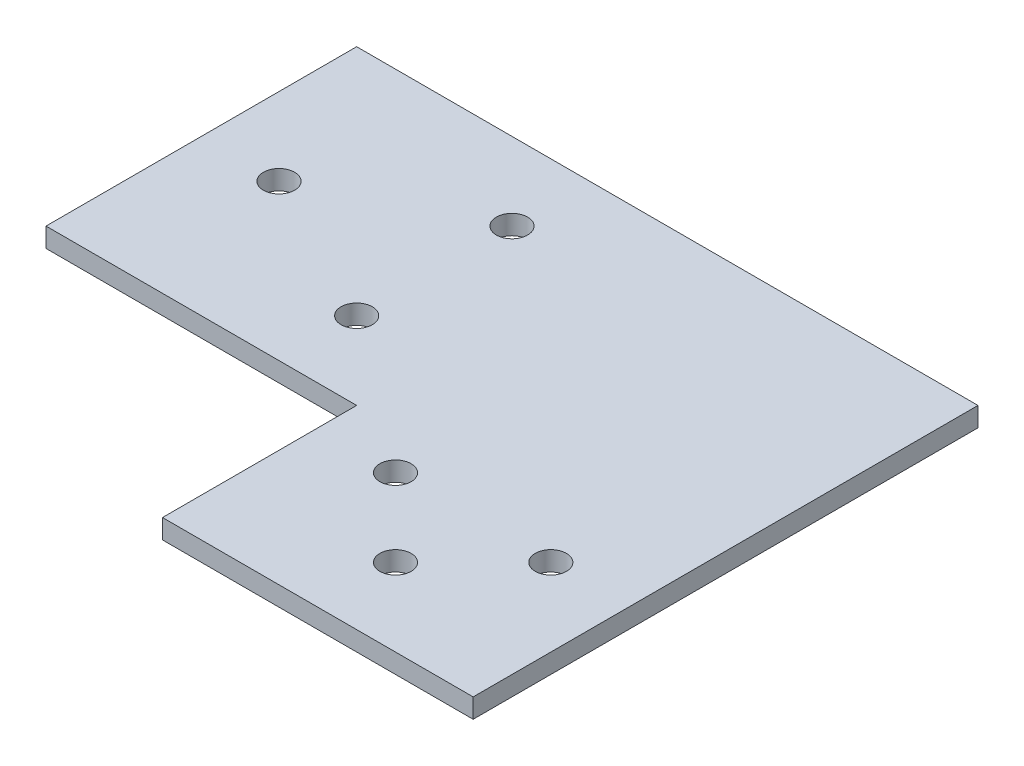
ISO-10303-21;
HEADER;
FILE_DESCRIPTION(('STEP AP214'),'2;1');
FILE_NAME('part.step','',(''),(''),'','','');
FILE_SCHEMA(('AUTOMOTIVE_DESIGN { 1 0 10303 214 1 1 1 1 }'));
ENDSEC;
DATA;
#1=APPLICATION_CONTEXT('core data for automotive mechanical design processes');
#2=APPLICATION_PROTOCOL_DEFINITION('international standard','automotive_design',2000,#1);
#3=PRODUCT_CONTEXT('',#1,'mechanical');
#4=PRODUCT('Part','Part','',(#3));
#5=PRODUCT_RELATED_PRODUCT_CATEGORY('part','',(#4));
#6=PRODUCT_DEFINITION_FORMATION('','',#4);
#7=PRODUCT_DEFINITION_CONTEXT('part definition',#1,'design');
#8=PRODUCT_DEFINITION('design','',#6,#7);
#9=PRODUCT_DEFINITION_SHAPE('','',#8);
#10=(LENGTH_UNIT() NAMED_UNIT(*) SI_UNIT(.MILLI.,.METRE.));
#11=(NAMED_UNIT(*) PLANE_ANGLE_UNIT() SI_UNIT($,.RADIAN.));
#12=(NAMED_UNIT(*) SI_UNIT($,.STERADIAN.) SOLID_ANGLE_UNIT());
#13=UNCERTAINTY_MEASURE_WITH_UNIT(LENGTH_MEASURE(1.E-05),#10,'distance_accuracy_value','');
#14=(GEOMETRIC_REPRESENTATION_CONTEXT(3) GLOBAL_UNCERTAINTY_ASSIGNED_CONTEXT((#13)) GLOBAL_UNIT_ASSIGNED_CONTEXT((#10,
#11,#12)) REPRESENTATION_CONTEXT('',''));
#15=CARTESIAN_POINT('',(0.,0.,0.));
#16=DIRECTION('',(0.,0.,1.));
#17=DIRECTION('',(1.,0.,0.));
#18=AXIS2_PLACEMENT_3D('',#15,#16,#17);
#19=CARTESIAN_POINT('',(0.,3.175,0.));
#20=DIRECTION('',(0.,-1.,0.));
#21=DIRECTION('',(0.,0.,-1.));
#22=AXIS2_PLACEMENT_3D('',#19,#20,#21);
#23=PLANE('',#22);
#24=DIRECTION('',(0.,0.,1.));
#25=VECTOR('',#24,1.);
#26=CARTESIAN_POINT('',(0.,3.175,0.));
#27=LINE('',#26,#25);
#28=CARTESIAN_POINT('',(0.,3.175,-50.8));
#29=VERTEX_POINT('',#28);
#30=CARTESIAN_POINT('',(0.,3.175,0.));
#31=VERTEX_POINT('',#30);
#32=EDGE_CURVE('E129',#29,#31,#27,.T.);
#33=ORIENTED_EDGE('',*,*,#32,.T.);
#34=DIRECTION('',(1.,0.,0.));
#35=VECTOR('',#34,1.);
#36=CARTESIAN_POINT('',(0.,3.175,0.));
#37=LINE('',#36,#35);
#38=CARTESIAN_POINT('',(50.8,3.175,0.));
#39=VERTEX_POINT('',#38);
#40=EDGE_CURVE('E87',#31,#39,#37,.T.);
#41=ORIENTED_EDGE('',*,*,#40,.T.);
#42=DIRECTION('',(0.,0.,1.));
#43=VECTOR('',#42,1.);
#44=CARTESIAN_POINT('',(50.8,3.175,0.));
#45=LINE('',#44,#43);
#46=CARTESIAN_POINT('',(50.8,3.175,31.75));
#47=VERTEX_POINT('',#46);
#48=EDGE_CURVE('E100',#39,#47,#45,.T.);
#49=ORIENTED_EDGE('',*,*,#48,.T.);
#50=DIRECTION('',(1.,0.,0.));
#51=VECTOR('',#50,1.);
#52=CARTESIAN_POINT('',(50.8,3.175,31.75));
#53=LINE('',#52,#51);
#54=CARTESIAN_POINT('',(101.6,3.175,31.75));
#55=VERTEX_POINT('',#54);
#56=EDGE_CURVE('E94',#47,#55,#53,.T.);
#57=ORIENTED_EDGE('',*,*,#56,.T.);
#58=DIRECTION('',(0.,0.,-1.));
#59=VECTOR('',#58,1.);
#60=CARTESIAN_POINT('',(101.6,3.175,-50.8));
#61=LINE('',#60,#59);
#62=CARTESIAN_POINT('',(101.6,3.175,-50.8));
#63=VERTEX_POINT('',#62);
#64=EDGE_CURVE('E98',#55,#63,#61,.T.);
#65=ORIENTED_EDGE('',*,*,#64,.T.);
#66=DIRECTION('',(-1.,0.,0.));
#67=VECTOR('',#66,1.);
#68=CARTESIAN_POINT('',(0.,3.175,-50.8));
#69=LINE('',#68,#67);
#70=EDGE_CURVE('E50',#63,#29,#69,.T.);
#71=ORIENTED_EDGE('',*,*,#70,.T.);
#72=EDGE_LOOP('',(#33,#41,#49,#57,#65,#71));
#73=FACE_BOUND('',#72,.T.);
#74=CARTESIAN_POINT('',(12.7,3.175,-25.4));
#75=DIRECTION('',(0.,1.,0.));
#76=DIRECTION('',(0.,0.,1.));
#77=AXIS2_PLACEMENT_3D('',#74,#75,#76);
#78=CIRCLE('',#77,2.5527);
#79=CARTESIAN_POINT('',(12.7,3.175,-22.8473));
#80=VERTEX_POINT('',#79);
#81=EDGE_CURVE('E122',#80,#80,#78,.T.);
#82=ORIENTED_EDGE('',*,*,#81,.F.);
#83=EDGE_LOOP('',(#82));
#84=FACE_BOUND('',#83,.T.);
#85=CARTESIAN_POINT('',(38.1,3.175,-12.7));
#86=DIRECTION('',(0.,1.,0.));
#87=DIRECTION('',(0.,0.,1.));
#88=AXIS2_PLACEMENT_3D('',#85,#86,#87);
#89=CIRCLE('',#88,2.5527);
#90=CARTESIAN_POINT('',(38.1,3.175,-10.1473));
#91=VERTEX_POINT('',#90);
#92=EDGE_CURVE('E213',#91,#91,#89,.T.);
#93=ORIENTED_EDGE('',*,*,#92,.F.);
#94=EDGE_LOOP('',(#93));
#95=FACE_BOUND('',#94,.T.);
#96=CARTESIAN_POINT('',(38.1,3.175,-38.1));
#97=DIRECTION('',(0.,1.,0.));
#98=DIRECTION('',(0.,0.,1.));
#99=AXIS2_PLACEMENT_3D('',#96,#97,#98);
#100=CIRCLE('',#99,2.55269999999999);
#101=CARTESIAN_POINT('',(38.1,3.175,-35.5473));
#102=VERTEX_POINT('',#101);
#103=EDGE_CURVE('E207',#102,#102,#100,.T.);
#104=ORIENTED_EDGE('',*,*,#103,.F.);
#105=EDGE_LOOP('',(#104));
#106=FACE_BOUND('',#105,.T.);
#107=CARTESIAN_POINT('',(63.5,3.175,6.35));
#108=DIRECTION('',(0.,1.,0.));
#109=DIRECTION('',(0.,0.,1.));
#110=AXIS2_PLACEMENT_3D('',#107,#108,#109);
#111=CIRCLE('',#110,2.55270000000001);
#112=CARTESIAN_POINT('',(63.5,3.175,8.90270000000001));
#113=VERTEX_POINT('',#112);
#114=EDGE_CURVE('E201',#113,#113,#111,.T.);
#115=ORIENTED_EDGE('',*,*,#114,.F.);
#116=EDGE_LOOP('',(#115));
#117=FACE_BOUND('',#116,.T.);
#118=CARTESIAN_POINT('',(88.9,3.175,6.35));
#119=DIRECTION('',(0.,1.,0.));
#120=DIRECTION('',(0.,0.,1.));
#121=AXIS2_PLACEMENT_3D('',#118,#119,#120);
#122=CIRCLE('',#121,2.55270000000001);
#123=CARTESIAN_POINT('',(88.9,3.175,8.90270000000001));
#124=VERTEX_POINT('',#123);
#125=EDGE_CURVE('E195',#124,#124,#122,.T.);
#126=ORIENTED_EDGE('',*,*,#125,.F.);
#127=EDGE_LOOP('',(#126));
#128=FACE_BOUND('',#127,.T.);
#129=CARTESIAN_POINT('',(76.2,3.175,19.05));
#130=DIRECTION('',(0.,1.,0.));
#131=DIRECTION('',(0.,0.,1.));
#132=AXIS2_PLACEMENT_3D('',#129,#130,#131);
#133=CIRCLE('',#132,2.55270000000001);
#134=CARTESIAN_POINT('',(76.2,3.175,21.6027));
#135=VERTEX_POINT('',#134);
#136=EDGE_CURVE('E186',#135,#135,#133,.T.);
#137=ORIENTED_EDGE('',*,*,#136,.F.);
#138=EDGE_LOOP('',(#137));
#139=FACE_BOUND('',#138,.T.);
#140=ADVANCED_FACE('F33',(#73,#84,#95,#106,#117,#128,#139),#23,.F.);
#141=CARTESIAN_POINT('',(0.,0.,0.));
#142=DIRECTION('',(0.,-1.,0.));
#143=DIRECTION('',(0.,0.,-1.));
#144=AXIS2_PLACEMENT_3D('',#141,#142,#143);
#145=PLANE('',#144);
#146=CARTESIAN_POINT('',(88.9,0.,6.35));
#147=DIRECTION('',(0.,1.,0.));
#148=DIRECTION('',(0.,0.,1.));
#149=AXIS2_PLACEMENT_3D('',#146,#147,#148);
#150=CIRCLE('',#149,2.55270000000001);
#151=CARTESIAN_POINT('',(88.9,0.,8.90270000000001));
#152=VERTEX_POINT('',#151);
#153=EDGE_CURVE('E192',#152,#152,#150,.T.);
#154=ORIENTED_EDGE('',*,*,#153,.T.);
#155=EDGE_LOOP('',(#154));
#156=FACE_BOUND('',#155,.T.);
#157=CARTESIAN_POINT('',(38.1,0.,-38.1));
#158=DIRECTION('',(0.,1.,0.));
#159=DIRECTION('',(0.,0.,1.));
#160=AXIS2_PLACEMENT_3D('',#157,#158,#159);
#161=CIRCLE('',#160,2.55269999999999);
#162=CARTESIAN_POINT('',(38.1,0.,-35.5473));
#163=VERTEX_POINT('',#162);
#164=EDGE_CURVE('E204',#163,#163,#161,.T.);
#165=ORIENTED_EDGE('',*,*,#164,.T.);
#166=EDGE_LOOP('',(#165));
#167=FACE_BOUND('',#166,.T.);
#168=CARTESIAN_POINT('',(12.7,0.,-25.4));
#169=DIRECTION('',(0.,1.,0.));
#170=DIRECTION('',(0.,0.,1.));
#171=AXIS2_PLACEMENT_3D('',#168,#169,#170);
#172=CIRCLE('',#171,2.5527);
#173=CARTESIAN_POINT('',(12.7,0.,-22.8473));
#174=VERTEX_POINT('',#173);
#175=EDGE_CURVE('E216',#174,#174,#172,.T.);
#176=ORIENTED_EDGE('',*,*,#175,.T.);
#177=EDGE_LOOP('',(#176));
#178=FACE_BOUND('',#177,.T.);
#179=DIRECTION('',(0.,0.,1.));
#180=VECTOR('',#179,1.);
#181=CARTESIAN_POINT('',(0.,0.,0.));
#182=LINE('',#181,#180);
#183=CARTESIAN_POINT('',(0.,0.,-50.8));
#184=VERTEX_POINT('',#183);
#185=CARTESIAN_POINT('',(0.,0.,0.));
#186=VERTEX_POINT('',#185);
#187=EDGE_CURVE('E118',#184,#186,#182,.T.);
#188=ORIENTED_EDGE('',*,*,#187,.F.);
#189=DIRECTION('',(-1.,0.,0.));
#190=VECTOR('',#189,1.);
#191=CARTESIAN_POINT('',(0.,0.,-50.8));
#192=LINE('',#191,#190);
#193=CARTESIAN_POINT('',(101.6,0.,-50.8));
#194=VERTEX_POINT('',#193);
#195=EDGE_CURVE('E79',#194,#184,#192,.T.);
#196=ORIENTED_EDGE('',*,*,#195,.F.);
#197=DIRECTION('',(0.,0.,-1.));
#198=VECTOR('',#197,1.);
#199=CARTESIAN_POINT('',(101.6,0.,-50.8));
#200=LINE('',#199,#198);
#201=CARTESIAN_POINT('',(101.6,0.,31.75));
#202=VERTEX_POINT('',#201);
#203=EDGE_CURVE('E73',#202,#194,#200,.T.);
#204=ORIENTED_EDGE('',*,*,#203,.F.);
#205=DIRECTION('',(1.,0.,0.));
#206=VECTOR('',#205,1.);
#207=CARTESIAN_POINT('',(50.8,0.,31.75));
#208=LINE('',#207,#206);
#209=CARTESIAN_POINT('',(50.8,0.,31.75));
#210=VERTEX_POINT('',#209);
#211=EDGE_CURVE('E108',#210,#202,#208,.T.);
#212=ORIENTED_EDGE('',*,*,#211,.F.);
#213=DIRECTION('',(0.,0.,1.));
#214=VECTOR('',#213,1.);
#215=CARTESIAN_POINT('',(50.8,0.,0.));
#216=LINE('',#215,#214);
#217=CARTESIAN_POINT('',(50.8,0.,0.));
#218=VERTEX_POINT('',#217);
#219=EDGE_CURVE('E124',#218,#210,#216,.T.);
#220=ORIENTED_EDGE('',*,*,#219,.F.);
#221=DIRECTION('',(1.,0.,0.));
#222=VECTOR('',#221,1.);
#223=CARTESIAN_POINT('',(0.,0.,0.));
#224=LINE('',#223,#222);
#225=EDGE_CURVE('E121',#186,#218,#224,.T.);
#226=ORIENTED_EDGE('',*,*,#225,.F.);
#227=EDGE_LOOP('',(#188,#196,#204,#212,#220,#226));
#228=FACE_BOUND('',#227,.T.);
#229=CARTESIAN_POINT('',(38.1,0.,-12.7));
#230=DIRECTION('',(0.,1.,0.));
#231=DIRECTION('',(0.,0.,1.));
#232=AXIS2_PLACEMENT_3D('',#229,#230,#231);
#233=CIRCLE('',#232,2.5527);
#234=CARTESIAN_POINT('',(38.1,0.,-10.1473));
#235=VERTEX_POINT('',#234);
#236=EDGE_CURVE('E210',#235,#235,#233,.T.);
#237=ORIENTED_EDGE('',*,*,#236,.T.);
#238=EDGE_LOOP('',(#237));
#239=FACE_BOUND('',#238,.T.);
#240=CARTESIAN_POINT('',(63.5,0.,6.35));
#241=DIRECTION('',(0.,1.,0.));
#242=DIRECTION('',(0.,0.,1.));
#243=AXIS2_PLACEMENT_3D('',#240,#241,#242);
#244=CIRCLE('',#243,2.55270000000001);
#245=CARTESIAN_POINT('',(63.5,0.,8.90270000000001));
#246=VERTEX_POINT('',#245);
#247=EDGE_CURVE('E198',#246,#246,#244,.T.);
#248=ORIENTED_EDGE('',*,*,#247,.T.);
#249=EDGE_LOOP('',(#248));
#250=FACE_BOUND('',#249,.T.);
#251=CARTESIAN_POINT('',(76.2,0.,19.05));
#252=DIRECTION('',(0.,1.,0.));
#253=DIRECTION('',(0.,0.,1.));
#254=AXIS2_PLACEMENT_3D('',#251,#252,#253);
#255=CIRCLE('',#254,2.55270000000001);
#256=CARTESIAN_POINT('',(76.2,0.,21.6027));
#257=VERTEX_POINT('',#256);
#258=EDGE_CURVE('E189',#257,#257,#255,.T.);
#259=ORIENTED_EDGE('',*,*,#258,.T.);
#260=EDGE_LOOP('',(#259));
#261=FACE_BOUND('',#260,.T.);
#262=ADVANCED_FACE('F138',(#156,#167,#178,#228,#239,#250,#261),#145,.T.);
#263=CARTESIAN_POINT('',(0.,3.175,0.));
#264=DIRECTION('',(1.,0.,0.));
#265=DIRECTION('',(0.,0.,-1.));
#266=AXIS2_PLACEMENT_3D('',#263,#264,#265);
#267=PLANE('',#266);
#268=ORIENTED_EDGE('',*,*,#187,.T.);
#269=DIRECTION('',(0.,-1.,0.));
#270=VECTOR('',#269,1.);
#271=CARTESIAN_POINT('',(0.,3.175,0.));
#272=LINE('',#271,#270);
#273=EDGE_CURVE('E11',#31,#186,#272,.T.);
#274=ORIENTED_EDGE('',*,*,#273,.F.);
#275=ORIENTED_EDGE('',*,*,#32,.F.);
#276=DIRECTION('',(0.,-1.,0.));
#277=VECTOR('',#276,1.);
#278=CARTESIAN_POINT('',(0.,3.175,-50.8));
#279=LINE('',#278,#277);
#280=EDGE_CURVE('E114',#29,#184,#279,.T.);
#281=ORIENTED_EDGE('',*,*,#280,.T.);
#282=EDGE_LOOP('',(#268,#274,#275,#281));
#283=FACE_BOUND('',#282,.T.);
#284=ADVANCED_FACE('F35',(#283),#267,.F.);
#285=CARTESIAN_POINT('',(0.,3.175,0.));
#286=DIRECTION('',(0.,0.,-1.));
#287=DIRECTION('',(-1.,0.,0.));
#288=AXIS2_PLACEMENT_3D('',#285,#286,#287);
#289=PLANE('',#288);
#290=ORIENTED_EDGE('',*,*,#225,.T.);
#291=DIRECTION('',(0.,-1.,0.));
#292=VECTOR('',#291,1.);
#293=CARTESIAN_POINT('',(50.8,3.175,0.));
#294=LINE('',#293,#292);
#295=EDGE_CURVE('E42',#39,#218,#294,.T.);
#296=ORIENTED_EDGE('',*,*,#295,.F.);
#297=ORIENTED_EDGE('',*,*,#40,.F.);
#298=ORIENTED_EDGE('',*,*,#273,.T.);
#299=EDGE_LOOP('',(#290,#296,#297,#298));
#300=FACE_BOUND('',#299,.T.);
#301=ADVANCED_FACE('F294',(#300),#289,.F.);
#302=CARTESIAN_POINT('',(50.8,3.175,0.));
#303=DIRECTION('',(1.,0.,0.));
#304=DIRECTION('',(0.,0.,-1.));
#305=AXIS2_PLACEMENT_3D('',#302,#303,#304);
#306=PLANE('',#305);
#307=ORIENTED_EDGE('',*,*,#219,.T.);
#308=DIRECTION('',(0.,-1.,0.));
#309=VECTOR('',#308,1.);
#310=CARTESIAN_POINT('',(50.8,3.175,31.75));
#311=LINE('',#310,#309);
#312=EDGE_CURVE('E109',#47,#210,#311,.T.);
#313=ORIENTED_EDGE('',*,*,#312,.F.);
#314=ORIENTED_EDGE('',*,*,#48,.F.);
#315=ORIENTED_EDGE('',*,*,#295,.T.);
#316=EDGE_LOOP('',(#307,#313,#314,#315));
#317=FACE_BOUND('',#316,.T.);
#318=ADVANCED_FACE('F135',(#317),#306,.F.);
#319=CARTESIAN_POINT('',(50.8,3.175,31.75));
#320=DIRECTION('',(0.,0.,-1.));
#321=DIRECTION('',(-1.,0.,0.));
#322=AXIS2_PLACEMENT_3D('',#319,#320,#321);
#323=PLANE('',#322);
#324=ORIENTED_EDGE('',*,*,#211,.T.);
#325=DIRECTION('',(0.,-1.,0.));
#326=VECTOR('',#325,1.);
#327=CARTESIAN_POINT('',(101.6,3.175,31.75));
#328=LINE('',#327,#326);
#329=EDGE_CURVE('E105',#55,#202,#328,.T.);
#330=ORIENTED_EDGE('',*,*,#329,.F.);
#331=ORIENTED_EDGE('',*,*,#56,.F.);
#332=ORIENTED_EDGE('',*,*,#312,.T.);
#333=EDGE_LOOP('',(#324,#330,#331,#332));
#334=FACE_BOUND('',#333,.T.);
#335=ADVANCED_FACE('F106',(#334),#323,.F.);
#336=CARTESIAN_POINT('',(101.6,3.175,-50.8));
#337=DIRECTION('',(-1.,0.,0.));
#338=DIRECTION('',(0.,0.,1.));
#339=AXIS2_PLACEMENT_3D('',#336,#337,#338);
#340=PLANE('',#339);
#341=ORIENTED_EDGE('',*,*,#203,.T.);
#342=DIRECTION('',(0.,-1.,0.));
#343=VECTOR('',#342,1.);
#344=CARTESIAN_POINT('',(101.6,3.175,-50.8));
#345=LINE('',#344,#343);
#346=EDGE_CURVE('E110',#63,#194,#345,.T.);
#347=ORIENTED_EDGE('',*,*,#346,.F.);
#348=ORIENTED_EDGE('',*,*,#64,.F.);
#349=ORIENTED_EDGE('',*,*,#329,.T.);
#350=EDGE_LOOP('',(#341,#347,#348,#349));
#351=FACE_BOUND('',#350,.T.);
#352=ADVANCED_FACE('F112',(#351),#340,.F.);
#353=CARTESIAN_POINT('',(0.,3.175,-50.8));
#354=DIRECTION('',(0.,0.,1.));
#355=DIRECTION('',(1.,0.,0.));
#356=AXIS2_PLACEMENT_3D('',#353,#354,#355);
#357=PLANE('',#356);
#358=ORIENTED_EDGE('',*,*,#195,.T.);
#359=ORIENTED_EDGE('',*,*,#280,.F.);
#360=ORIENTED_EDGE('',*,*,#70,.F.);
#361=ORIENTED_EDGE('',*,*,#346,.T.);
#362=EDGE_LOOP('',(#358,#359,#360,#361));
#363=FACE_BOUND('',#362,.T.);
#364=ADVANCED_FACE('F143',(#363),#357,.F.);
#365=CARTESIAN_POINT('',(12.7,3.175,-25.4));
#366=DIRECTION('',(0.,-1.,0.));
#367=DIRECTION('',(0.,0.,-1.));
#368=AXIS2_PLACEMENT_3D('',#365,#366,#367);
#369=CYLINDRICAL_SURFACE('',#368,2.5527);
#370=ORIENTED_EDGE('',*,*,#81,.T.);
#371=EDGE_LOOP('',(#370));
#372=FACE_BOUND('',#371,.T.);
#373=ORIENTED_EDGE('',*,*,#175,.F.);
#374=EDGE_LOOP('',(#373));
#375=FACE_BOUND('',#374,.T.);
#376=ADVANCED_FACE('F145',(#372,#375),#369,.F.);
#377=CARTESIAN_POINT('',(38.1,3.175,-12.7));
#378=DIRECTION('',(0.,-1.,0.));
#379=DIRECTION('',(0.,0.,-1.));
#380=AXIS2_PLACEMENT_3D('',#377,#378,#379);
#381=CYLINDRICAL_SURFACE('',#380,2.5527);
#382=ORIENTED_EDGE('',*,*,#92,.T.);
#383=EDGE_LOOP('',(#382));
#384=FACE_BOUND('',#383,.T.);
#385=ORIENTED_EDGE('',*,*,#236,.F.);
#386=EDGE_LOOP('',(#385));
#387=FACE_BOUND('',#386,.T.);
#388=ADVANCED_FACE('F151',(#384,#387),#381,.F.);
#389=CARTESIAN_POINT('',(38.1,3.175,-38.1));
#390=DIRECTION('',(0.,-1.,0.));
#391=DIRECTION('',(0.,0.,-1.));
#392=AXIS2_PLACEMENT_3D('',#389,#390,#391);
#393=CYLINDRICAL_SURFACE('',#392,2.55269999999999);
#394=ORIENTED_EDGE('',*,*,#103,.T.);
#395=EDGE_LOOP('',(#394));
#396=FACE_BOUND('',#395,.T.);
#397=ORIENTED_EDGE('',*,*,#164,.F.);
#398=EDGE_LOOP('',(#397));
#399=FACE_BOUND('',#398,.T.);
#400=ADVANCED_FACE('F165',(#396,#399),#393,.F.);
#401=CARTESIAN_POINT('',(63.5,3.175,6.35));
#402=DIRECTION('',(0.,-1.,0.));
#403=DIRECTION('',(0.,0.,-1.));
#404=AXIS2_PLACEMENT_3D('',#401,#402,#403);
#405=CYLINDRICAL_SURFACE('',#404,2.55270000000001);
#406=ORIENTED_EDGE('',*,*,#114,.T.);
#407=EDGE_LOOP('',(#406));
#408=FACE_BOUND('',#407,.T.);
#409=ORIENTED_EDGE('',*,*,#247,.F.);
#410=EDGE_LOOP('',(#409));
#411=FACE_BOUND('',#410,.T.);
#412=ADVANCED_FACE('F169',(#408,#411),#405,.F.);
#413=CARTESIAN_POINT('',(88.9,3.175,6.35));
#414=DIRECTION('',(0.,-1.,0.));
#415=DIRECTION('',(0.,0.,-1.));
#416=AXIS2_PLACEMENT_3D('',#413,#414,#415);
#417=CYLINDRICAL_SURFACE('',#416,2.55270000000001);
#418=ORIENTED_EDGE('',*,*,#125,.T.);
#419=EDGE_LOOP('',(#418));
#420=FACE_BOUND('',#419,.T.);
#421=ORIENTED_EDGE('',*,*,#153,.F.);
#422=EDGE_LOOP('',(#421));
#423=FACE_BOUND('',#422,.T.);
#424=ADVANCED_FACE('F173',(#420,#423),#417,.F.);
#425=CARTESIAN_POINT('',(76.2,3.175,19.05));
#426=DIRECTION('',(0.,-1.,0.));
#427=DIRECTION('',(0.,0.,-1.));
#428=AXIS2_PLACEMENT_3D('',#425,#426,#427);
#429=CYLINDRICAL_SURFACE('',#428,2.55270000000001);
#430=ORIENTED_EDGE('',*,*,#136,.T.);
#431=EDGE_LOOP('',(#430));
#432=FACE_BOUND('',#431,.T.);
#433=ORIENTED_EDGE('',*,*,#258,.F.);
#434=EDGE_LOOP('',(#433));
#435=FACE_BOUND('',#434,.T.);
#436=ADVANCED_FACE('F177',(#432,#435),#429,.F.);
#437=CLOSED_SHELL('',(#140,#262,#284,#301,#318,#335,#352,#364,#376,#388,#400,#412,#424,#436));
#438=MANIFOLD_SOLID_BREP('B2',#437);
#439=ADVANCED_BREP_SHAPE_REPRESENTATION('',(#18,#438),#14);
#440=SHAPE_DEFINITION_REPRESENTATION(#9,#439);
ENDSEC;
END-ISO-10303-21;
